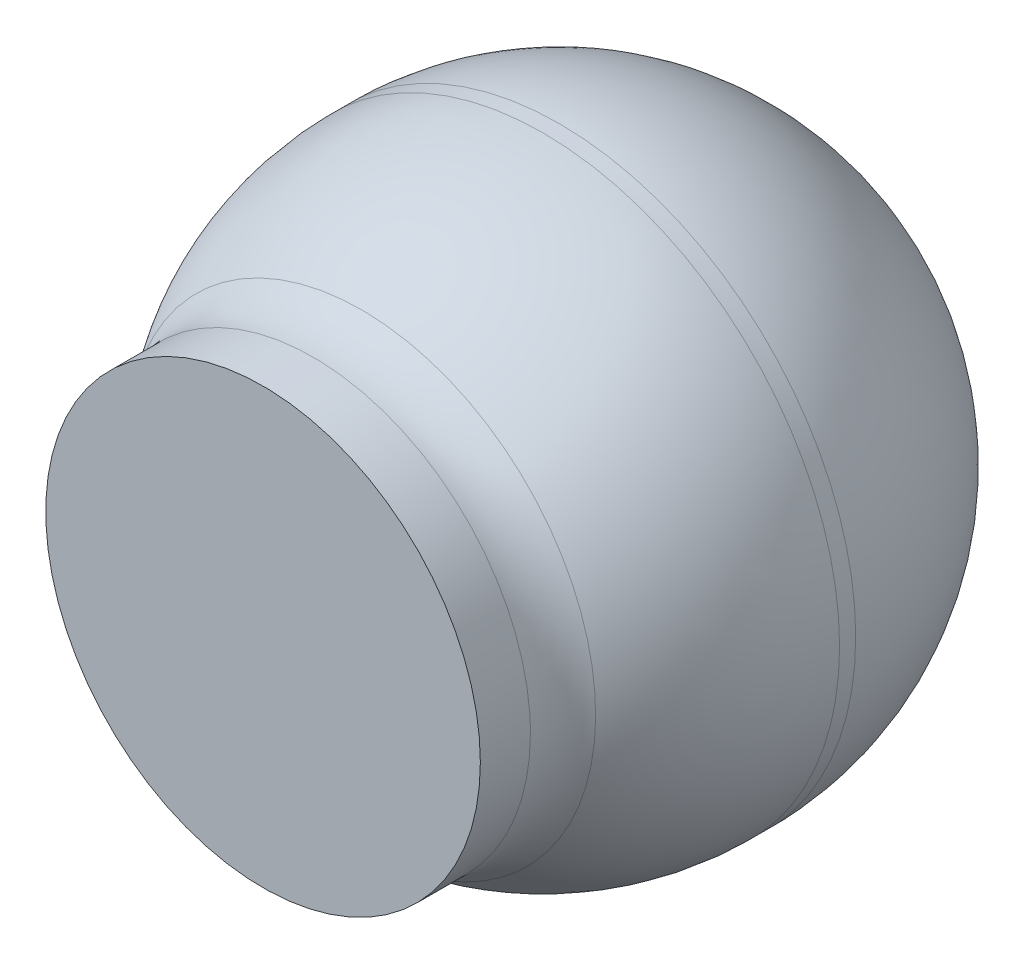
ISO-10303-21;
HEADER;
FILE_DESCRIPTION(('STEP AP214'),'2;1');
FILE_NAME('part.step','',(''),(''),'','','');
FILE_SCHEMA(('AUTOMOTIVE_DESIGN { 1 0 10303 214 1 1 1 1 }'));
ENDSEC;
DATA;
#1=APPLICATION_CONTEXT('core data for automotive mechanical design processes');
#2=APPLICATION_PROTOCOL_DEFINITION('international standard','automotive_design',2000,#1);
#3=PRODUCT_CONTEXT('',#1,'mechanical');
#4=PRODUCT('Part','Part','',(#3));
#5=PRODUCT_RELATED_PRODUCT_CATEGORY('part','',(#4));
#6=PRODUCT_DEFINITION_FORMATION('','',#4);
#7=PRODUCT_DEFINITION_CONTEXT('part definition',#1,'design');
#8=PRODUCT_DEFINITION('design','',#6,#7);
#9=PRODUCT_DEFINITION_SHAPE('','',#8);
#10=(LENGTH_UNIT() NAMED_UNIT(*) SI_UNIT(.MILLI.,.METRE.));
#11=(NAMED_UNIT(*) PLANE_ANGLE_UNIT() SI_UNIT($,.RADIAN.));
#12=(NAMED_UNIT(*) SI_UNIT($,.STERADIAN.) SOLID_ANGLE_UNIT());
#13=UNCERTAINTY_MEASURE_WITH_UNIT(LENGTH_MEASURE(1.E-05),#10,'distance_accuracy_value','');
#14=(GEOMETRIC_REPRESENTATION_CONTEXT(3) GLOBAL_UNCERTAINTY_ASSIGNED_CONTEXT((#13)) GLOBAL_UNIT_ASSIGNED_CONTEXT((#10,
#11,#12)) REPRESENTATION_CONTEXT('',''));
#15=CARTESIAN_POINT('',(0.,0.,0.));
#16=DIRECTION('',(0.,0.,1.));
#17=DIRECTION('',(1.,0.,0.));
#18=AXIS2_PLACEMENT_3D('',#15,#16,#17);
#19=CARTESIAN_POINT('',(-1.832919922269,-4.051349291452,10.006534503384));
#20=DIRECTION('',(0.,0.,-1.));
#21=DIRECTION('',(-1.,0.,0.));
#22=AXIS2_PLACEMENT_3D('',#19,#20,#21);
#23=PLANE('',#22);
#24=CARTESIAN_POINT('',(-1.832919922269,-4.051349291452,10.006534503384));
#25=DIRECTION('',(0.,0.,1.));
#26=DIRECTION('',(1.,0.,0.));
#27=AXIS2_PLACEMENT_3D('',#24,#25,#26);
#28=CIRCLE('',#27,0.275);
#29=CARTESIAN_POINT('',(-1.557919922269,-4.051349291452,10.006534503384));
#30=VERTEX_POINT('',#29);
#31=EDGE_CURVE('E20',#30,#30,#28,.F.);
#32=ORIENTED_EDGE('',*,*,#31,.F.);
#33=EDGE_LOOP('',(#32));
#34=FACE_BOUND('',#33,.T.);
#35=ADVANCED_FACE('F17',(#34),#23,.F.);
#36=CARTESIAN_POINT('',(-1.832919922269,-4.051349291452,9.906534503384));
#37=DIRECTION('',(0.,0.,1.));
#38=DIRECTION('',(1.,0.,0.));
#39=AXIS2_PLACEMENT_3D('',#36,#37,#38);
#40=CYLINDRICAL_SURFACE('',#39,0.275);
#41=CARTESIAN_POINT('',(-1.832919922269,-4.051349291452,9.943180457728));
#42=DIRECTION('',(0.,0.,-1.));
#43=DIRECTION('',(0.996700902337583,0.0811622527992438,0.));
#44=AXIS2_PLACEMENT_3D('',#41,#42,#43);
#45=CIRCLE('',#44,0.275);
#46=CARTESIAN_POINT('',(-1.55882717412616,-4.02902967193221,9.943180457728));
#47=VERTEX_POINT('',#46);
#48=EDGE_CURVE('E65',#47,#47,#45,.F.);
#49=ORIENTED_EDGE('',*,*,#48,.T.);
#50=EDGE_LOOP('',(#49));
#51=FACE_BOUND('',#50,.T.);
#52=ORIENTED_EDGE('',*,*,#31,.T.);
#53=EDGE_LOOP('',(#52));
#54=FACE_BOUND('',#53,.T.);
#55=ADVANCED_FACE('F62',(#51,#54),#40,.T.);
#56=CARTESIAN_POINT('',(-1.832919922269,-4.051349291452,9.943180457728));
#57=DIRECTION('',(0.,0.,-1.));
#58=DIRECTION('',(0.996700902337583,0.0811622527992448,0.));
#59=AXIS2_PLACEMENT_3D('',#56,#57,#58);
#60=TOROIDAL_SURFACE('',#59,0.375,0.1);
#61=ORIENTED_EDGE('',*,*,#48,.F.);
#62=EDGE_LOOP('',(#61));
#63=FACE_BOUND('',#62,.T.);
#64=CARTESIAN_POINT('',(-1.832919922269,-4.051349291452,9.881744931236));
#65=DIRECTION('',(0.,0.,-1.));
#66=DIRECTION('',(-0.996700902337598,-0.0811622527990593,0.));
#67=AXIS2_PLACEMENT_3D('',#64,#65,#66);
#68=CIRCLE('',#67,0.296097046412665);
#69=CARTESIAN_POINT('',(-2.128040115608,-4.075381194786,9.881744931236));
#70=VERTEX_POINT('',#69);
#71=EDGE_CURVE('E39',#70,#70,#68,.T.);
#72=ORIENTED_EDGE('',*,*,#71,.F.);
#73=EDGE_LOOP('',(#72));
#74=FACE_BOUND('',#73,.T.);
#75=ADVANCED_FACE('F57',(#63,#74),#60,.F.);
#76=CARTESIAN_POINT('',(-2.206682760645,-4.081785136252,9.651976062157));
#77=CARTESIAN_POINT('',(-2.206682760645,-4.081785136252,9.701461392103));
#78=CARTESIAN_POINT('',(-2.198526217348,-4.081120941579,9.750947004335));
#79=CARTESIAN_POINT('',(-2.182207085349,-4.079792059952,9.798626332798));
#80=CARTESIAN_POINT('',(-2.158341390838,-4.077848654938,9.842699544317));
#81=CARTESIAN_POINT('',(-2.128040115608,-4.075381194786,9.881744931236));
#82=(BOUNDED_CURVE() B_SPLINE_CURVE(5,(#76,#77,#78,#79,#80,#81),.UNSPECIFIED.,.F.,
.F.) B_SPLINE_CURVE_WITH_KNOTS((6,6),(0.,0.661568582165),
.UNSPECIFIED.) CURVE() GEOMETRIC_REPRESENTATION_ITEM() RATIONAL_B_SPLINE_CURVE((1.,1.,1.,1.,1.,1.)) REPRESENTATION_ITEM(''));
#83=CARTESIAN_POINT('',(-1.832919922269,-4.051349291452,9.651976062157));
#84=DIRECTION('',(0.,0.,-1.));
#85=AXIS1_PLACEMENT('',#83,#84);
#86=SURFACE_OF_REVOLUTION('',#82,#85);
#87=CARTESIAN_POINT('',(-1.832919922269,-4.051349291452,9.651976062157));
#88=DIRECTION('',(0.,0.,1.));
#89=DIRECTION('',(1.,0.,0.));
#90=AXIS2_PLACEMENT_3D('',#87,#88,#89);
#91=CIRCLE('',#90,0.375);
#92=CARTESIAN_POINT('',(-1.457919922269,-4.051349291452,9.651976062157));
#93=VERTEX_POINT('',#92);
#94=EDGE_CURVE('E36',#93,#93,#91,.F.);
#95=ORIENTED_EDGE('',*,*,#94,.F.);
#96=EDGE_LOOP('',(#95));
#97=FACE_BOUND('',#96,.T.);
#98=ORIENTED_EDGE('',*,*,#71,.T.);
#99=EDGE_LOOP('',(#98));
#100=FACE_BOUND('',#99,.T.);
#101=ADVANCED_FACE('F53',(#97,#100),#86,.F.);
#102=CARTESIAN_POINT('',(-1.832919922269,-4.051349291452,9.256534503384));
#103=DIRECTION('',(0.,0.,1.));
#104=DIRECTION('',(1.,0.,0.));
#105=AXIS2_PLACEMENT_3D('',#102,#103,#104);
#106=CYLINDRICAL_SURFACE('',#105,0.375);
#107=CARTESIAN_POINT('',(-1.832919922269,-4.051349291452,9.631534503384));
#108=DIRECTION('',(0.,0.,-1.));
#109=DIRECTION('',(0.0811622527992362,-0.996700902337583,0.));
#110=AXIS2_PLACEMENT_3D('',#107,#108,#109);
#111=CIRCLE('',#110,0.375);
#112=CARTESIAN_POINT('',(-1.80248407746929,-4.42511212982859,9.631534503384));
#113=VERTEX_POINT('',#112);
#114=CARTESIAN_POINT('',(-1.86335576706871,-3.67758645307541,9.631534503384));
#115=VERTEX_POINT('',#114);
#116=EDGE_CURVE('E11',#113,#115,#111,.T.);
#117=ORIENTED_EDGE('',*,*,#116,.F.);
#118=CARTESIAN_POINT('',(-1.832919922269,-4.051349291452,9.631534503384));
#119=DIRECTION('',(0.,0.,1.));
#120=DIRECTION('',(0.0811622527992359,-0.996700902337583,0.));
#121=AXIS2_PLACEMENT_3D('',#118,#119,#120);
#122=CIRCLE('',#121,0.375);
#123=EDGE_CURVE('E25',#115,#113,#122,.F.);
#124=ORIENTED_EDGE('',*,*,#123,.F.);
#125=EDGE_LOOP('',(#117,#124));
#126=FACE_BOUND('',#125,.T.);
#127=ORIENTED_EDGE('',*,*,#94,.T.);
#128=EDGE_LOOP('',(#127));
#129=FACE_BOUND('',#128,.T.);
#130=ADVANCED_FACE('F34',(#126,#129),#106,.T.);
#131=CARTESIAN_POINT('',(-1.832919922269,-4.051349291452,9.631534503384));
#132=DIRECTION('',(0.0811622527992361,-0.996700902337583,0.));
#133=DIRECTION('',(-0.996700902337583,-0.0811622527992361,0.));
#134=AXIS2_PLACEMENT_3D('',#131,#132,#133);
#135=SPHERICAL_SURFACE('',#134,0.375);
#136=ORIENTED_EDGE('',*,*,#123,.T.);
#137=ORIENTED_EDGE('',*,*,#116,.T.);
#138=EDGE_LOOP('',(#136,#137));
#139=FACE_BOUND('',#138,.T.);
#140=ADVANCED_FACE('F32',(#139),#135,.T.);
#141=CLOSED_SHELL('',(#35,#55,#75,#101,#130,#140));
#142=MANIFOLD_SOLID_BREP('B1',#141);
#143=ADVANCED_BREP_SHAPE_REPRESENTATION('',(#18,#142),#14);
#144=SHAPE_DEFINITION_REPRESENTATION(#9,#143);
ENDSEC;
END-ISO-10303-21;
